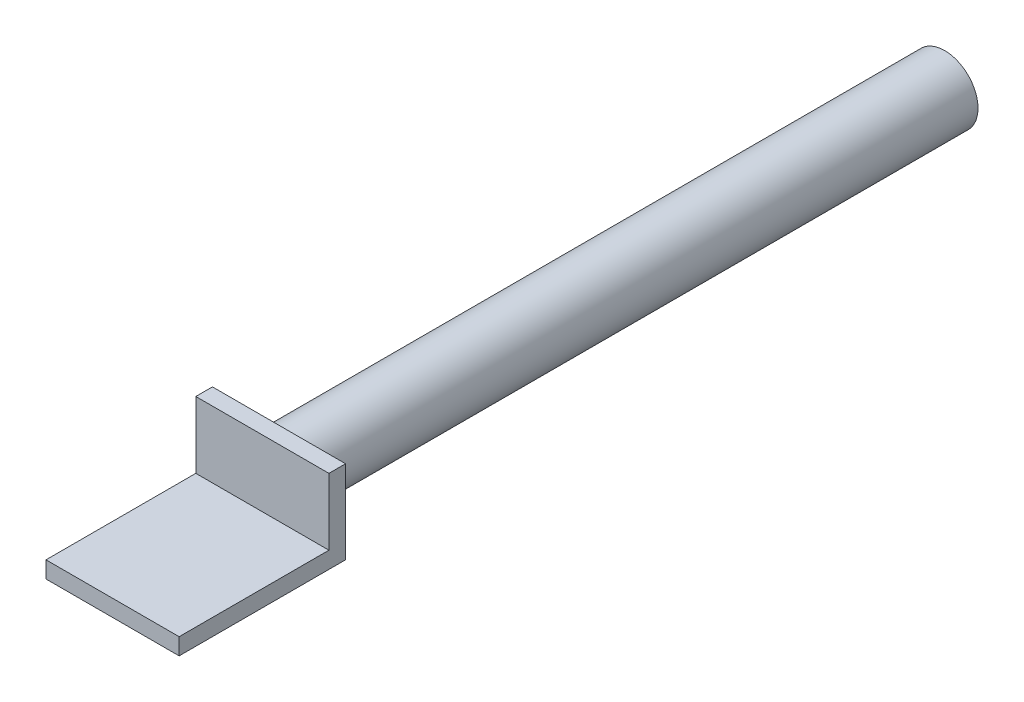
ISO-10303-21;
HEADER;
FILE_DESCRIPTION(('STEP AP214'),'2;1');
FILE_NAME('part.step','',(''),(''),'','','');
FILE_SCHEMA(('AUTOMOTIVE_DESIGN { 1 0 10303 214 1 1 1 1 }'));
ENDSEC;
DATA;
#1=APPLICATION_CONTEXT('core data for automotive mechanical design processes');
#2=APPLICATION_PROTOCOL_DEFINITION('international standard','automotive_design',2000,#1);
#3=PRODUCT_CONTEXT('',#1,'mechanical');
#4=PRODUCT('Part','Part','',(#3));
#5=PRODUCT_RELATED_PRODUCT_CATEGORY('part','',(#4));
#6=PRODUCT_DEFINITION_FORMATION('','',#4);
#7=PRODUCT_DEFINITION_CONTEXT('part definition',#1,'design');
#8=PRODUCT_DEFINITION('design','',#6,#7);
#9=PRODUCT_DEFINITION_SHAPE('','',#8);
#10=(LENGTH_UNIT() NAMED_UNIT(*) SI_UNIT(.MILLI.,.METRE.));
#11=(NAMED_UNIT(*) PLANE_ANGLE_UNIT() SI_UNIT($,.RADIAN.));
#12=(NAMED_UNIT(*) SI_UNIT($,.STERADIAN.) SOLID_ANGLE_UNIT());
#13=UNCERTAINTY_MEASURE_WITH_UNIT(LENGTH_MEASURE(1.E-05),#10,'distance_accuracy_value','');
#14=(GEOMETRIC_REPRESENTATION_CONTEXT(3) GLOBAL_UNCERTAINTY_ASSIGNED_CONTEXT((#13)) GLOBAL_UNIT_ASSIGNED_CONTEXT((#10,
#11,#12)) REPRESENTATION_CONTEXT('',''));
#15=CARTESIAN_POINT('',(0.,0.,0.));
#16=DIRECTION('',(0.,0.,1.));
#17=DIRECTION('',(1.,0.,0.));
#18=AXIS2_PLACEMENT_3D('',#15,#16,#17);
#19=CARTESIAN_POINT('',(0.,0.,254.));
#20=DIRECTION('',(0.,0.,-1.));
#21=DIRECTION('',(-1.,0.,0.));
#22=AXIS2_PLACEMENT_3D('',#19,#20,#21);
#23=CYLINDRICAL_SURFACE('',#22,12.7);
#24=CARTESIAN_POINT('',(0.,0.,254.));
#25=DIRECTION('',(0.,0.,1.));
#26=DIRECTION('',(1.,0.,0.));
#27=AXIS2_PLACEMENT_3D('',#24,#25,#26);
#28=CIRCLE('',#27,12.7);
#29=CARTESIAN_POINT('',(12.7,0.,254.));
#30=VERTEX_POINT('',#29);
#31=EDGE_CURVE('E11',#30,#30,#28,.T.);
#32=ORIENTED_EDGE('',*,*,#31,.F.);
#33=EDGE_LOOP('',(#32));
#34=FACE_BOUND('',#33,.T.);
#35=CARTESIAN_POINT('',(0.,0.,0.));
#36=DIRECTION('',(0.,0.,1.));
#37=DIRECTION('',(1.,0.,0.));
#38=AXIS2_PLACEMENT_3D('',#35,#36,#37);
#39=CIRCLE('',#38,12.7);
#40=CARTESIAN_POINT('',(12.7,0.,0.));
#41=VERTEX_POINT('',#40);
#42=EDGE_CURVE('E38',#41,#41,#39,.T.);
#43=ORIENTED_EDGE('',*,*,#42,.T.);
#44=EDGE_LOOP('',(#43));
#45=FACE_BOUND('',#44,.T.);
#46=ADVANCED_FACE('F35',(#34,#45),#23,.T.);
#47=CARTESIAN_POINT('',(0.,0.,0.));
#48=DIRECTION('',(0.,0.,1.));
#49=DIRECTION('',(1.,0.,0.));
#50=AXIS2_PLACEMENT_3D('',#47,#48,#49);
#51=PLANE('',#50);
#52=ORIENTED_EDGE('',*,*,#42,.F.);
#53=EDGE_LOOP('',(#52));
#54=FACE_BOUND('',#53,.T.);
#55=ADVANCED_FACE('F119',(#54),#51,.F.);
#56=CARTESIAN_POINT('',(25.4,15.875,317.5));
#57=DIRECTION('',(-1.,0.,0.));
#58=DIRECTION('',(0.,-1.,0.));
#59=AXIS2_PLACEMENT_3D('',#56,#57,#58);
#60=PLANE('',#59);
#61=DIRECTION('',(0.,0.,-1.));
#62=VECTOR('',#61,1.);
#63=CARTESIAN_POINT('',(25.4,15.875,317.5));
#64=LINE('',#63,#62);
#65=CARTESIAN_POINT('',(25.4,15.875,260.35));
#66=VERTEX_POINT('',#65);
#67=CARTESIAN_POINT('',(25.4,15.875,254.));
#68=VERTEX_POINT('',#67);
#69=EDGE_CURVE('E112',#66,#68,#64,.T.);
#70=ORIENTED_EDGE('',*,*,#69,.F.);
#71=DIRECTION('',(0.,1.,0.));
#72=VECTOR('',#71,1.);
#73=CARTESIAN_POINT('',(25.4,15.875,260.35));
#74=LINE('',#73,#72);
#75=CARTESIAN_POINT('',(25.4,-9.525,260.35));
#76=VERTEX_POINT('',#75);
#77=EDGE_CURVE('E172',#76,#66,#74,.T.);
#78=ORIENTED_EDGE('',*,*,#77,.F.);
#79=DIRECTION('',(0.,0.,-1.));
#80=VECTOR('',#79,1.);
#81=CARTESIAN_POINT('',(25.4,-9.525,317.5));
#82=LINE('',#81,#80);
#83=CARTESIAN_POINT('',(25.4,-9.525,317.5));
#84=VERTEX_POINT('',#83);
#85=EDGE_CURVE('E164',#84,#76,#82,.T.);
#86=ORIENTED_EDGE('',*,*,#85,.F.);
#87=DIRECTION('',(0.,1.,0.));
#88=VECTOR('',#87,1.);
#89=CARTESIAN_POINT('',(25.4,15.875,317.5));
#90=LINE('',#89,#88);
#91=CARTESIAN_POINT('',(25.4,-15.875,317.5));
#92=VERTEX_POINT('',#91);
#93=EDGE_CURVE('E87',#92,#84,#90,.T.);
#94=ORIENTED_EDGE('',*,*,#93,.F.);
#95=DIRECTION('',(0.,0.,-1.));
#96=VECTOR('',#95,1.);
#97=CARTESIAN_POINT('',(25.4,-15.875,317.5));
#98=LINE('',#97,#96);
#99=CARTESIAN_POINT('',(25.4,-15.875,254.));
#100=VERTEX_POINT('',#99);
#101=EDGE_CURVE('E80',#92,#100,#98,.T.);
#102=ORIENTED_EDGE('',*,*,#101,.T.);
#103=DIRECTION('',(0.,1.,0.));
#104=VECTOR('',#103,1.);
#105=CARTESIAN_POINT('',(25.4,15.875,254.));
#106=LINE('',#105,#104);
#107=EDGE_CURVE('E94',#100,#68,#106,.T.);
#108=ORIENTED_EDGE('',*,*,#107,.T.);
#109=EDGE_LOOP('',(#70,#78,#86,#94,#102,#108));
#110=FACE_BOUND('',#109,.T.);
#111=ADVANCED_FACE('F93',(#110),#60,.F.);
#112=CARTESIAN_POINT('',(-25.4,15.875,317.5));
#113=DIRECTION('',(0.,-1.,0.));
#114=DIRECTION('',(0.,0.,-1.));
#115=AXIS2_PLACEMENT_3D('',#112,#113,#114);
#116=PLANE('',#115);
#117=DIRECTION('',(0.,0.,-1.));
#118=VECTOR('',#117,1.);
#119=CARTESIAN_POINT('',(-25.4,15.875,317.5));
#120=LINE('',#119,#118);
#121=CARTESIAN_POINT('',(-25.4,15.875,260.35));
#122=VERTEX_POINT('',#121);
#123=CARTESIAN_POINT('',(-25.4,15.875,254.));
#124=VERTEX_POINT('',#123);
#125=EDGE_CURVE('E110',#122,#124,#120,.T.);
#126=ORIENTED_EDGE('',*,*,#125,.F.);
#127=DIRECTION('',(1.,0.,0.));
#128=VECTOR('',#127,1.);
#129=CARTESIAN_POINT('',(-25.401,15.875,260.35));
#130=LINE('',#129,#128);
#131=EDGE_CURVE('E103',#122,#66,#130,.T.);
#132=ORIENTED_EDGE('',*,*,#131,.T.);
#133=ORIENTED_EDGE('',*,*,#69,.T.);
#134=DIRECTION('',(-1.,0.,0.));
#135=VECTOR('',#134,1.);
#136=CARTESIAN_POINT('',(-25.4,15.875,254.));
#137=LINE('',#136,#135);
#138=EDGE_CURVE('E100',#68,#124,#137,.T.);
#139=ORIENTED_EDGE('',*,*,#138,.T.);
#140=EDGE_LOOP('',(#126,#132,#133,#139));
#141=FACE_BOUND('',#140,.T.);
#142=ADVANCED_FACE('F125',(#141),#116,.F.);
#143=CARTESIAN_POINT('',(-25.4,15.875,317.5));
#144=DIRECTION('',(1.,0.,0.));
#145=DIRECTION('',(0.,1.,0.));
#146=AXIS2_PLACEMENT_3D('',#143,#144,#145);
#147=PLANE('',#146);
#148=DIRECTION('',(0.,0.,1.));
#149=VECTOR('',#148,1.);
#150=CARTESIAN_POINT('',(-25.4,-9.52500000000001,317.5));
#151=LINE('',#150,#149);
#152=CARTESIAN_POINT('',(-25.4,-9.52500000000001,260.35));
#153=VERTEX_POINT('',#152);
#154=CARTESIAN_POINT('',(-25.4,-9.52500000000001,317.5));
#155=VERTEX_POINT('',#154);
#156=EDGE_CURVE('E49',#153,#155,#151,.T.);
#157=ORIENTED_EDGE('',*,*,#156,.F.);
#158=DIRECTION('',(0.,-1.,0.));
#159=VECTOR('',#158,1.);
#160=CARTESIAN_POINT('',(-25.4,15.875,260.35));
#161=LINE('',#160,#159);
#162=EDGE_CURVE('E156',#122,#153,#161,.T.);
#163=ORIENTED_EDGE('',*,*,#162,.F.);
#164=ORIENTED_EDGE('',*,*,#125,.T.);
#165=DIRECTION('',(0.,-1.,0.));
#166=VECTOR('',#165,1.);
#167=CARTESIAN_POINT('',(-25.4,15.875,254.));
#168=LINE('',#167,#166);
#169=CARTESIAN_POINT('',(-25.4,-15.875,254.));
#170=VERTEX_POINT('',#169);
#171=EDGE_CURVE('E88',#124,#170,#168,.T.);
#172=ORIENTED_EDGE('',*,*,#171,.T.);
#173=DIRECTION('',(0.,0.,-1.));
#174=VECTOR('',#173,1.);
#175=CARTESIAN_POINT('',(-25.4,-15.875,317.5));
#176=LINE('',#175,#174);
#177=CARTESIAN_POINT('',(-25.4,-15.875,317.5));
#178=VERTEX_POINT('',#177);
#179=EDGE_CURVE('E83',#178,#170,#176,.T.);
#180=ORIENTED_EDGE('',*,*,#179,.F.);
#181=DIRECTION('',(0.,-1.,0.));
#182=VECTOR('',#181,1.);
#183=CARTESIAN_POINT('',(-25.4,15.875,317.5));
#184=LINE('',#183,#182);
#185=EDGE_CURVE('E167',#155,#178,#184,.T.);
#186=ORIENTED_EDGE('',*,*,#185,.F.);
#187=EDGE_LOOP('',(#157,#163,#164,#172,#180,#186));
#188=FACE_BOUND('',#187,.T.);
#189=ADVANCED_FACE('F131',(#188),#147,.F.);
#190=CARTESIAN_POINT('',(-25.4,-15.875,317.5));
#191=DIRECTION('',(0.,1.,0.));
#192=DIRECTION('',(0.,0.,1.));
#193=AXIS2_PLACEMENT_3D('',#190,#191,#192);
#194=PLANE('',#193);
#195=DIRECTION('',(1.,0.,0.));
#196=VECTOR('',#195,1.);
#197=CARTESIAN_POINT('',(-25.4,-15.875,254.));
#198=LINE('',#197,#196);
#199=EDGE_CURVE('E77',#170,#100,#198,.T.);
#200=ORIENTED_EDGE('',*,*,#199,.T.);
#201=ORIENTED_EDGE('',*,*,#101,.F.);
#202=DIRECTION('',(1.,0.,0.));
#203=VECTOR('',#202,1.);
#204=CARTESIAN_POINT('',(-25.4,-15.875,317.5));
#205=LINE('',#204,#203);
#206=EDGE_CURVE('E58',#178,#92,#205,.T.);
#207=ORIENTED_EDGE('',*,*,#206,.F.);
#208=ORIENTED_EDGE('',*,*,#179,.T.);
#209=EDGE_LOOP('',(#200,#201,#207,#208));
#210=FACE_BOUND('',#209,.T.);
#211=ADVANCED_FACE('F79',(#210),#194,.F.);
#212=CARTESIAN_POINT('',(0.,0.,317.5));
#213=DIRECTION('',(0.,0.,1.));
#214=DIRECTION('',(1.,0.,0.));
#215=AXIS2_PLACEMENT_3D('',#212,#213,#214);
#216=PLANE('',#215);
#217=DIRECTION('',(1.,0.,0.));
#218=VECTOR('',#217,1.);
#219=CARTESIAN_POINT('',(-25.401,-9.52500000000001,317.5));
#220=LINE('',#219,#218);
#221=EDGE_CURVE('E170',#155,#84,#220,.T.);
#222=ORIENTED_EDGE('',*,*,#221,.F.);
#223=ORIENTED_EDGE('',*,*,#185,.T.);
#224=ORIENTED_EDGE('',*,*,#206,.T.);
#225=ORIENTED_EDGE('',*,*,#93,.T.);
#226=EDGE_LOOP('',(#222,#223,#224,#225));
#227=FACE_BOUND('',#226,.T.);
#228=ADVANCED_FACE('F137',(#227),#216,.T.);
#229=CARTESIAN_POINT('',(0.,0.,254.));
#230=DIRECTION('',(0.,0.,1.));
#231=DIRECTION('',(1.,0.,0.));
#232=AXIS2_PLACEMENT_3D('',#229,#230,#231);
#233=PLANE('',#232);
#234=ORIENTED_EDGE('',*,*,#31,.T.);
#235=EDGE_LOOP('',(#234));
#236=FACE_BOUND('',#235,.T.);
#237=ORIENTED_EDGE('',*,*,#107,.F.);
#238=ORIENTED_EDGE('',*,*,#199,.F.);
#239=ORIENTED_EDGE('',*,*,#171,.F.);
#240=ORIENTED_EDGE('',*,*,#138,.F.);
#241=EDGE_LOOP('',(#237,#238,#239,#240));
#242=FACE_BOUND('',#241,.T.);
#243=ADVANCED_FACE('F98',(#236,#242),#233,.F.);
#244=CARTESIAN_POINT('',(-25.401,15.875,260.35));
#245=DIRECTION('',(0.,0.,-1.));
#246=DIRECTION('',(-1.,0.,0.));
#247=AXIS2_PLACEMENT_3D('',#244,#245,#246);
#248=PLANE('',#247);
#249=ORIENTED_EDGE('',*,*,#162,.T.);
#250=DIRECTION('',(1.,0.,0.));
#251=VECTOR('',#250,1.);
#252=CARTESIAN_POINT('',(-25.401,-9.52500000000001,260.35));
#253=LINE('',#252,#251);
#254=EDGE_CURVE('E159',#153,#76,#253,.T.);
#255=ORIENTED_EDGE('',*,*,#254,.T.);
#256=ORIENTED_EDGE('',*,*,#77,.T.);
#257=ORIENTED_EDGE('',*,*,#131,.F.);
#258=EDGE_LOOP('',(#249,#255,#256,#257));
#259=FACE_BOUND('',#258,.T.);
#260=ADVANCED_FACE('F140',(#259),#248,.F.);
#261=CARTESIAN_POINT('',(-25.401,-9.52500000000001,317.5));
#262=DIRECTION('',(0.,-1.,0.));
#263=DIRECTION('',(1.,0.,0.));
#264=AXIS2_PLACEMENT_3D('',#261,#262,#263);
#265=PLANE('',#264);
#266=ORIENTED_EDGE('',*,*,#156,.T.);
#267=ORIENTED_EDGE('',*,*,#221,.T.);
#268=ORIENTED_EDGE('',*,*,#85,.T.);
#269=ORIENTED_EDGE('',*,*,#254,.F.);
#270=EDGE_LOOP('',(#266,#267,#268,#269));
#271=FACE_BOUND('',#270,.T.);
#272=ADVANCED_FACE('F144',(#271),#265,.F.);
#273=CLOSED_SHELL('',(#46,#55,#111,#142,#189,#211,#228,#243,#260,#272));
#274=MANIFOLD_SOLID_BREP('B2',#273);
#275=ADVANCED_BREP_SHAPE_REPRESENTATION('',(#18,#274),#14);
#276=SHAPE_DEFINITION_REPRESENTATION(#9,#275);
ENDSEC;
END-ISO-10303-21;
